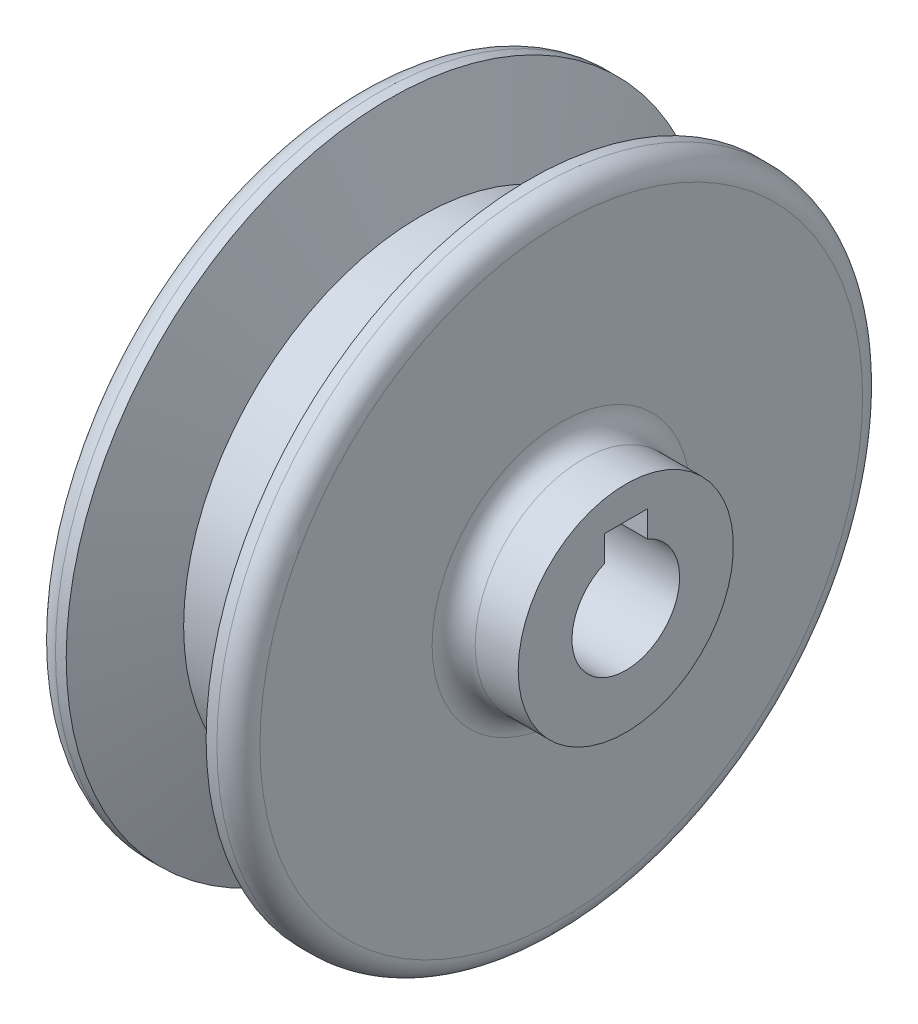
ISO-10303-21;
HEADER;
FILE_DESCRIPTION(('STEP AP214'),'2;1');
FILE_NAME('part.step','',(''),(''),'','','');
FILE_SCHEMA(('AUTOMOTIVE_DESIGN { 1 0 10303 214 1 1 1 1 }'));
ENDSEC;
DATA;
#1=APPLICATION_CONTEXT('core data for automotive mechanical design processes');
#2=APPLICATION_PROTOCOL_DEFINITION('international standard','automotive_design',2000,#1);
#3=PRODUCT_CONTEXT('',#1,'mechanical');
#4=PRODUCT('Part','Part','',(#3));
#5=PRODUCT_RELATED_PRODUCT_CATEGORY('part','',(#4));
#6=PRODUCT_DEFINITION_FORMATION('','',#4);
#7=PRODUCT_DEFINITION_CONTEXT('part definition',#1,'design');
#8=PRODUCT_DEFINITION('design','',#6,#7);
#9=PRODUCT_DEFINITION_SHAPE('','',#8);
#10=(LENGTH_UNIT() NAMED_UNIT(*) SI_UNIT(.MILLI.,.METRE.));
#11=(NAMED_UNIT(*) PLANE_ANGLE_UNIT() SI_UNIT($,.RADIAN.));
#12=(NAMED_UNIT(*) SI_UNIT($,.STERADIAN.) SOLID_ANGLE_UNIT());
#13=UNCERTAINTY_MEASURE_WITH_UNIT(LENGTH_MEASURE(1.E-05),#10,'distance_accuracy_value','');
#14=(GEOMETRIC_REPRESENTATION_CONTEXT(3) GLOBAL_UNCERTAINTY_ASSIGNED_CONTEXT((#13)) GLOBAL_UNIT_ASSIGNED_CONTEXT((#10,
#11,#12)) REPRESENTATION_CONTEXT('',''));
#15=CARTESIAN_POINT('',(0.,0.,0.));
#16=DIRECTION('',(0.,0.,1.));
#17=DIRECTION('',(1.,0.,0.));
#18=AXIS2_PLACEMENT_3D('',#15,#16,#17);
#19=CARTESIAN_POINT('',(21.,0.,0.));
#20=DIRECTION('',(-1.,0.,0.));
#21=DIRECTION('',(0.,0.,1.));
#22=AXIS2_PLACEMENT_3D('',#19,#20,#21);
#23=TOROIDAL_SURFACE('',#22,12.,2.);
#24=CARTESIAN_POINT('',(19.,0.,0.));
#25=DIRECTION('',(-1.,0.,0.));
#26=DIRECTION('',(0.,0.,1.));
#27=AXIS2_PLACEMENT_3D('',#24,#25,#26);
#28=CIRCLE('',#27,12.);
#29=CARTESIAN_POINT('',(19.,0.,12.));
#30=VERTEX_POINT('',#29);
#31=EDGE_CURVE('E46',#30,#30,#28,.T.);
#32=ORIENTED_EDGE('',*,*,#31,.F.);
#33=EDGE_LOOP('',(#32));
#34=FACE_BOUND('',#33,.T.);
#35=CARTESIAN_POINT('',(21.,0.,0.));
#36=DIRECTION('',(-1.,0.,0.));
#37=DIRECTION('',(0.,0.,1.));
#38=AXIS2_PLACEMENT_3D('',#35,#36,#37);
#39=CIRCLE('',#38,10.);
#40=CARTESIAN_POINT('',(21.,0.,10.));
#41=VERTEX_POINT('',#40);
#42=EDGE_CURVE('E107',#41,#41,#39,.T.);
#43=ORIENTED_EDGE('',*,*,#42,.T.);
#44=EDGE_LOOP('',(#43));
#45=FACE_BOUND('',#44,.T.);
#46=ADVANCED_FACE('F39',(#34,#45),#23,.F.);
#47=CARTESIAN_POINT('',(19.,28.,0.));
#48=DIRECTION('',(-1.,0.,0.));
#49=DIRECTION('',(0.,0.,1.));
#50=AXIS2_PLACEMENT_3D('',#47,#48,#49);
#51=PLANE('',#50);
#52=CARTESIAN_POINT('',(19.,0.,0.));
#53=DIRECTION('',(-1.,0.,0.));
#54=DIRECTION('',(0.,0.,1.));
#55=AXIS2_PLACEMENT_3D('',#52,#53,#54);
#56=CIRCLE('',#55,28.);
#57=CARTESIAN_POINT('',(19.,0.,28.));
#58=VERTEX_POINT('',#57);
#59=EDGE_CURVE('E139',#58,#58,#56,.T.);
#60=ORIENTED_EDGE('',*,*,#59,.F.);
#61=EDGE_LOOP('',(#60));
#62=FACE_BOUND('',#61,.T.);
#63=ORIENTED_EDGE('',*,*,#31,.T.);
#64=EDGE_LOOP('',(#63));
#65=FACE_BOUND('',#64,.T.);
#66=ADVANCED_FACE('F144',(#62,#65),#51,.F.);
#67=CARTESIAN_POINT('',(17.,0.,0.));
#68=DIRECTION('',(-1.,0.,0.));
#69=DIRECTION('',(0.,0.,1.));
#70=AXIS2_PLACEMENT_3D('',#67,#68,#69);
#71=TOROIDAL_SURFACE('',#70,28.,1.99999999999999);
#72=CARTESIAN_POINT('',(17.,0.,0.));
#73=DIRECTION('',(-1.,0.,0.));
#74=DIRECTION('',(0.,0.,1.));
#75=AXIS2_PLACEMENT_3D('',#72,#73,#74);
#76=CIRCLE('',#75,30.);
#77=CARTESIAN_POINT('',(17.,0.,30.));
#78=VERTEX_POINT('',#77);
#79=EDGE_CURVE('E136',#78,#78,#76,.T.);
#80=ORIENTED_EDGE('',*,*,#79,.F.);
#81=EDGE_LOOP('',(#80));
#82=FACE_BOUND('',#81,.T.);
#83=ORIENTED_EDGE('',*,*,#59,.T.);
#84=EDGE_LOOP('',(#83));
#85=FACE_BOUND('',#84,.T.);
#86=ADVANCED_FACE('F195',(#82,#85),#71,.T.);
#87=CARTESIAN_POINT('',(-3.78242127428419,0.,0.));
#88=DIRECTION('',(-1.,0.,0.));
#89=DIRECTION('',(0.,0.,1.));
#90=AXIS2_PLACEMENT_3D('',#87,#88,#89);
#91=CYLINDRICAL_SURFACE('',#90,30.);
#92=CARTESIAN_POINT('',(16.,0.,0.));
#93=DIRECTION('',(-1.,0.,0.));
#94=DIRECTION('',(0.,0.,1.));
#95=AXIS2_PLACEMENT_3D('',#92,#93,#94);
#96=CIRCLE('',#95,30.);
#97=CARTESIAN_POINT('',(16.,0.,30.));
#98=VERTEX_POINT('',#97);
#99=EDGE_CURVE('E133',#98,#98,#96,.T.);
#100=ORIENTED_EDGE('',*,*,#99,.F.);
#101=EDGE_LOOP('',(#100));
#102=FACE_BOUND('',#101,.T.);
#103=ORIENTED_EDGE('',*,*,#79,.T.);
#104=EDGE_LOOP('',(#103));
#105=FACE_BOUND('',#104,.T.);
#106=ADVANCED_FACE('F191',(#102,#105),#91,.T.);
#107=CARTESIAN_POINT('',(16.,0.,0.));
#108=DIRECTION('',(1.,0.,0.));
#109=DIRECTION('',(0.,0.,-1.));
#110=AXIS2_PLACEMENT_3D('',#107,#108,#109);
#111=CONICAL_SURFACE('',#110,30.,1.22173047639604);
#112=CARTESIAN_POINT('',(13.0882381258704,0.,0.));
#113=DIRECTION('',(-1.,0.,0.));
#114=DIRECTION('',(0.,0.,1.));
#115=AXIS2_PLACEMENT_3D('',#112,#113,#114);
#116=CIRCLE('',#115,22.);
#117=CARTESIAN_POINT('',(13.0882381258704,0.,22.));
#118=VERTEX_POINT('',#117);
#119=EDGE_CURVE('E130',#118,#118,#116,.T.);
#120=ORIENTED_EDGE('',*,*,#119,.F.);
#121=EDGE_LOOP('',(#120));
#122=FACE_BOUND('',#121,.T.);
#123=ORIENTED_EDGE('',*,*,#99,.T.);
#124=EDGE_LOOP('',(#123));
#125=FACE_BOUND('',#124,.T.);
#126=ADVANCED_FACE('F187',(#122,#125),#111,.T.);
#127=CARTESIAN_POINT('',(-3.78242127428419,0.,0.));
#128=DIRECTION('',(-1.,0.,0.));
#129=DIRECTION('',(0.,0.,1.));
#130=AXIS2_PLACEMENT_3D('',#127,#128,#129);
#131=CYLINDRICAL_SURFACE('',#130,22.);
#132=CARTESIAN_POINT('',(5.91176187412963,0.,0.));
#133=DIRECTION('',(-1.,0.,0.));
#134=DIRECTION('',(0.,0.,1.));
#135=AXIS2_PLACEMENT_3D('',#132,#133,#134);
#136=CIRCLE('',#135,22.);
#137=CARTESIAN_POINT('',(5.91176187412963,0.,22.));
#138=VERTEX_POINT('',#137);
#139=EDGE_CURVE('E127',#138,#138,#136,.T.);
#140=ORIENTED_EDGE('',*,*,#139,.F.);
#141=EDGE_LOOP('',(#140));
#142=FACE_BOUND('',#141,.T.);
#143=ORIENTED_EDGE('',*,*,#119,.T.);
#144=EDGE_LOOP('',(#143));
#145=FACE_BOUND('',#144,.T.);
#146=ADVANCED_FACE('F183',(#142,#145),#131,.T.);
#147=CARTESIAN_POINT('',(5.91176187412963,0.,0.));
#148=DIRECTION('',(-1.,0.,0.));
#149=DIRECTION('',(0.,0.,1.));
#150=AXIS2_PLACEMENT_3D('',#147,#148,#149);
#151=CONICAL_SURFACE('',#150,22.,1.22173047639603);
#152=CARTESIAN_POINT('',(3.,0.,0.));
#153=DIRECTION('',(-1.,0.,0.));
#154=DIRECTION('',(0.,0.,1.));
#155=AXIS2_PLACEMENT_3D('',#152,#153,#154);
#156=CIRCLE('',#155,30.);
#157=CARTESIAN_POINT('',(3.,0.,30.));
#158=VERTEX_POINT('',#157);
#159=EDGE_CURVE('E124',#158,#158,#156,.T.);
#160=ORIENTED_EDGE('',*,*,#159,.F.);
#161=EDGE_LOOP('',(#160));
#162=FACE_BOUND('',#161,.T.);
#163=ORIENTED_EDGE('',*,*,#139,.T.);
#164=EDGE_LOOP('',(#163));
#165=FACE_BOUND('',#164,.T.);
#166=ADVANCED_FACE('F179',(#162,#165),#151,.T.);
#167=CARTESIAN_POINT('',(-3.78242127428419,0.,0.));
#168=DIRECTION('',(-1.,0.,0.));
#169=DIRECTION('',(0.,0.,1.));
#170=AXIS2_PLACEMENT_3D('',#167,#168,#169);
#171=CYLINDRICAL_SURFACE('',#170,30.);
#172=CARTESIAN_POINT('',(2.00000000000001,0.,0.));
#173=DIRECTION('',(-1.,0.,0.));
#174=DIRECTION('',(0.,0.,1.));
#175=AXIS2_PLACEMENT_3D('',#172,#173,#174);
#176=CIRCLE('',#175,30.);
#177=CARTESIAN_POINT('',(2.00000000000001,0.,30.));
#178=VERTEX_POINT('',#177);
#179=EDGE_CURVE('E121',#178,#178,#176,.T.);
#180=ORIENTED_EDGE('',*,*,#179,.F.);
#181=EDGE_LOOP('',(#180));
#182=FACE_BOUND('',#181,.T.);
#183=ORIENTED_EDGE('',*,*,#159,.T.);
#184=EDGE_LOOP('',(#183));
#185=FACE_BOUND('',#184,.T.);
#186=ADVANCED_FACE('F175',(#182,#185),#171,.T.);
#187=CARTESIAN_POINT('',(2.00000000000001,0.,0.));
#188=DIRECTION('',(-1.,0.,0.));
#189=DIRECTION('',(0.,0.,1.));
#190=AXIS2_PLACEMENT_3D('',#187,#188,#189);
#191=TOROIDAL_SURFACE('',#190,28.,2.);
#192=CARTESIAN_POINT('',(0.,0.,0.));
#193=DIRECTION('',(-1.,0.,0.));
#194=DIRECTION('',(0.,0.,1.));
#195=AXIS2_PLACEMENT_3D('',#192,#193,#194);
#196=CIRCLE('',#195,28.);
#197=CARTESIAN_POINT('',(0.,0.,28.));
#198=VERTEX_POINT('',#197);
#199=EDGE_CURVE('E118',#198,#198,#196,.T.);
#200=ORIENTED_EDGE('',*,*,#199,.F.);
#201=EDGE_LOOP('',(#200));
#202=FACE_BOUND('',#201,.T.);
#203=ORIENTED_EDGE('',*,*,#179,.T.);
#204=EDGE_LOOP('',(#203));
#205=FACE_BOUND('',#204,.T.);
#206=ADVANCED_FACE('F171',(#202,#205),#191,.T.);
#207=CARTESIAN_POINT('',(0.,5.,0.));
#208=DIRECTION('',(1.,0.,0.));
#209=DIRECTION('',(0.,0.,-1.));
#210=AXIS2_PLACEMENT_3D('',#207,#208,#209);
#211=PLANE('',#210);
#212=DIRECTION('',(0.,0.,1.));
#213=VECTOR('',#212,1.);
#214=CARTESIAN_POINT('',(0.,7.,0.));
#215=LINE('',#214,#213);
#216=CARTESIAN_POINT('',(0.,7.,-2.));
#217=VERTEX_POINT('',#216);
#218=CARTESIAN_POINT('',(0.,7.,2.));
#219=VERTEX_POINT('',#218);
#220=EDGE_CURVE('E86',#217,#219,#215,.T.);
#221=ORIENTED_EDGE('',*,*,#220,.T.);
#222=DIRECTION('',(0.,-1.,0.));
#223=VECTOR('',#222,1.);
#224=CARTESIAN_POINT('',(0.,5.,2.));
#225=LINE('',#224,#223);
#226=CARTESIAN_POINT('',(0.,4.58257569495584,2.));
#227=VERTEX_POINT('',#226);
#228=EDGE_CURVE('E105',#219,#227,#225,.T.);
#229=ORIENTED_EDGE('',*,*,#228,.T.);
#230=CARTESIAN_POINT('',(0.,0.,0.));
#231=DIRECTION('',(-1.,0.,0.));
#232=DIRECTION('',(0.,0.,1.));
#233=AXIS2_PLACEMENT_3D('',#230,#231,#232);
#234=CIRCLE('',#233,5.);
#235=CARTESIAN_POINT('',(0.,4.58257569495584,-2.));
#236=VERTEX_POINT('',#235);
#237=EDGE_CURVE('E115',#236,#227,#234,.T.);
#238=ORIENTED_EDGE('',*,*,#237,.F.);
#239=DIRECTION('',(0.,1.,0.));
#240=VECTOR('',#239,1.);
#241=CARTESIAN_POINT('',(0.,5.,-2.));
#242=LINE('',#241,#240);
#243=EDGE_CURVE('E101',#236,#217,#242,.T.);
#244=ORIENTED_EDGE('',*,*,#243,.T.);
#245=EDGE_LOOP('',(#221,#229,#238,#244));
#246=FACE_BOUND('',#245,.T.);
#247=ORIENTED_EDGE('',*,*,#199,.T.);
#248=EDGE_LOOP('',(#247));
#249=FACE_BOUND('',#248,.T.);
#250=ADVANCED_FACE('F164',(#246,#249),#211,.F.);
#251=CARTESIAN_POINT('',(-3.78242127428419,0.,0.));
#252=DIRECTION('',(-1.,0.,0.));
#253=DIRECTION('',(0.,0.,1.));
#254=AXIS2_PLACEMENT_3D('',#251,#252,#253);
#255=CYLINDRICAL_SURFACE('',#254,5.);
#256=ORIENTED_EDGE('',*,*,#237,.T.);
#257=DIRECTION('',(-1.,0.,0.));
#258=VECTOR('',#257,1.);
#259=CARTESIAN_POINT('',(-3.78242127428419,4.58257569495584,2.));
#260=LINE('',#259,#258);
#261=CARTESIAN_POINT('',(25.,4.58257569495584,2.));
#262=VERTEX_POINT('',#261);
#263=EDGE_CURVE('E60',#227,#262,#260,.F.);
#264=ORIENTED_EDGE('',*,*,#263,.T.);
#265=CARTESIAN_POINT('',(25.,0.,0.));
#266=DIRECTION('',(-1.,0.,0.));
#267=DIRECTION('',(0.,0.,1.));
#268=AXIS2_PLACEMENT_3D('',#265,#266,#267);
#269=CIRCLE('',#268,5.);
#270=CARTESIAN_POINT('',(25.,4.58257569495584,-2.));
#271=VERTEX_POINT('',#270);
#272=EDGE_CURVE('E113',#271,#262,#269,.T.);
#273=ORIENTED_EDGE('',*,*,#272,.F.);
#274=DIRECTION('',(-1.,0.,0.));
#275=VECTOR('',#274,1.);
#276=CARTESIAN_POINT('',(-3.78242127428419,4.58257569495584,-2.));
#277=LINE('',#276,#275);
#278=EDGE_CURVE('E53',#271,#236,#277,.T.);
#279=ORIENTED_EDGE('',*,*,#278,.T.);
#280=EDGE_LOOP('',(#256,#264,#273,#279));
#281=FACE_BOUND('',#280,.T.);
#282=ADVANCED_FACE('F158',(#281),#255,.F.);
#283=CARTESIAN_POINT('',(25.,5.,0.));
#284=DIRECTION('',(-1.,0.,0.));
#285=DIRECTION('',(0.,0.,1.));
#286=AXIS2_PLACEMENT_3D('',#283,#284,#285);
#287=PLANE('',#286);
#288=CARTESIAN_POINT('',(25.,0.,0.));
#289=DIRECTION('',(-1.,0.,0.));
#290=DIRECTION('',(0.,0.,1.));
#291=AXIS2_PLACEMENT_3D('',#288,#289,#290);
#292=CIRCLE('',#291,10.);
#293=CARTESIAN_POINT('',(25.,0.,10.));
#294=VERTEX_POINT('',#293);
#295=EDGE_CURVE('E110',#294,#294,#292,.T.);
#296=ORIENTED_EDGE('',*,*,#295,.F.);
#297=EDGE_LOOP('',(#296));
#298=FACE_BOUND('',#297,.T.);
#299=ORIENTED_EDGE('',*,*,#272,.T.);
#300=DIRECTION('',(0.,-1.,0.));
#301=VECTOR('',#300,1.);
#302=CARTESIAN_POINT('',(25.,7.,2.));
#303=LINE('',#302,#301);
#304=CARTESIAN_POINT('',(25.,7.,2.));
#305=VERTEX_POINT('',#304);
#306=EDGE_CURVE('E95',#305,#262,#303,.T.);
#307=ORIENTED_EDGE('',*,*,#306,.F.);
#308=DIRECTION('',(0.,0.,1.));
#309=VECTOR('',#308,1.);
#310=CARTESIAN_POINT('',(25.,7.,2.));
#311=LINE('',#310,#309);
#312=CARTESIAN_POINT('',(25.,7.,-2.));
#313=VERTEX_POINT('',#312);
#314=EDGE_CURVE('E83',#313,#305,#311,.T.);
#315=ORIENTED_EDGE('',*,*,#314,.F.);
#316=DIRECTION('',(0.,-1.,0.));
#317=VECTOR('',#316,1.);
#318=CARTESIAN_POINT('',(25.,5.,-2.));
#319=LINE('',#318,#317);
#320=EDGE_CURVE('E11',#313,#271,#319,.T.);
#321=ORIENTED_EDGE('',*,*,#320,.T.);
#322=EDGE_LOOP('',(#299,#307,#315,#321));
#323=FACE_BOUND('',#322,.T.);
#324=ADVANCED_FACE('F94',(#298,#323),#287,.F.);
#325=CARTESIAN_POINT('',(-3.78242127428419,0.,0.));
#326=DIRECTION('',(-1.,0.,0.));
#327=DIRECTION('',(0.,0.,1.));
#328=AXIS2_PLACEMENT_3D('',#325,#326,#327);
#329=CYLINDRICAL_SURFACE('',#328,10.);
#330=ORIENTED_EDGE('',*,*,#42,.F.);
#331=EDGE_LOOP('',(#330));
#332=FACE_BOUND('',#331,.T.);
#333=ORIENTED_EDGE('',*,*,#295,.T.);
#334=EDGE_LOOP('',(#333));
#335=FACE_BOUND('',#334,.T.);
#336=ADVANCED_FACE('F150',(#332,#335),#329,.T.);
#337=CARTESIAN_POINT('',(-15.,7.,2.));
#338=DIRECTION('',(0.,0.,1.));
#339=DIRECTION('',(0.,-1.,0.));
#340=AXIS2_PLACEMENT_3D('',#337,#338,#339);
#341=PLANE('',#340);
#342=DIRECTION('',(1.,0.,0.));
#343=VECTOR('',#342,1.);
#344=CARTESIAN_POINT('',(-15.,7.,2.));
#345=LINE('',#344,#343);
#346=EDGE_CURVE('E88',#219,#305,#345,.T.);
#347=ORIENTED_EDGE('',*,*,#346,.T.);
#348=ORIENTED_EDGE('',*,*,#306,.T.);
#349=ORIENTED_EDGE('',*,*,#263,.F.);
#350=ORIENTED_EDGE('',*,*,#228,.F.);
#351=EDGE_LOOP('',(#347,#348,#349,#350));
#352=FACE_BOUND('',#351,.T.);
#353=ADVANCED_FACE('F153',(#352),#341,.F.);
#354=CARTESIAN_POINT('',(-15.,7.,2.));
#355=DIRECTION('',(0.,1.,0.));
#356=DIRECTION('',(0.,0.,1.));
#357=AXIS2_PLACEMENT_3D('',#354,#355,#356);
#358=PLANE('',#357);
#359=DIRECTION('',(1.,0.,0.));
#360=VECTOR('',#359,1.);
#361=CARTESIAN_POINT('',(-15.,7.,-2.));
#362=LINE('',#361,#360);
#363=EDGE_CURVE('E79',#217,#313,#362,.T.);
#364=ORIENTED_EDGE('',*,*,#363,.T.);
#365=ORIENTED_EDGE('',*,*,#314,.T.);
#366=ORIENTED_EDGE('',*,*,#346,.F.);
#367=ORIENTED_EDGE('',*,*,#220,.F.);
#368=EDGE_LOOP('',(#364,#365,#366,#367));
#369=FACE_BOUND('',#368,.T.);
#370=ADVANCED_FACE('F80',(#369),#358,.F.);
#371=CARTESIAN_POINT('',(-15.,7.,-2.));
#372=DIRECTION('',(0.,0.,-1.));
#373=DIRECTION('',(0.,1.,0.));
#374=AXIS2_PLACEMENT_3D('',#371,#372,#373);
#375=PLANE('',#374);
#376=ORIENTED_EDGE('',*,*,#278,.F.);
#377=ORIENTED_EDGE('',*,*,#320,.F.);
#378=ORIENTED_EDGE('',*,*,#363,.F.);
#379=ORIENTED_EDGE('',*,*,#243,.F.);
#380=EDGE_LOOP('',(#376,#377,#378,#379));
#381=FACE_BOUND('',#380,.T.);
#382=ADVANCED_FACE('F90',(#381),#375,.F.);
#383=CLOSED_SHELL('',(#46,#66,#86,#106,#126,#146,#166,#186,#206,#250,#282,#324,#336,#353,#370,#382));
#384=MANIFOLD_SOLID_BREP('B2',#383);
#385=ADVANCED_BREP_SHAPE_REPRESENTATION('',(#18,#384),#14);
#386=SHAPE_DEFINITION_REPRESENTATION(#9,#385);
ENDSEC;
END-ISO-10303-21;
